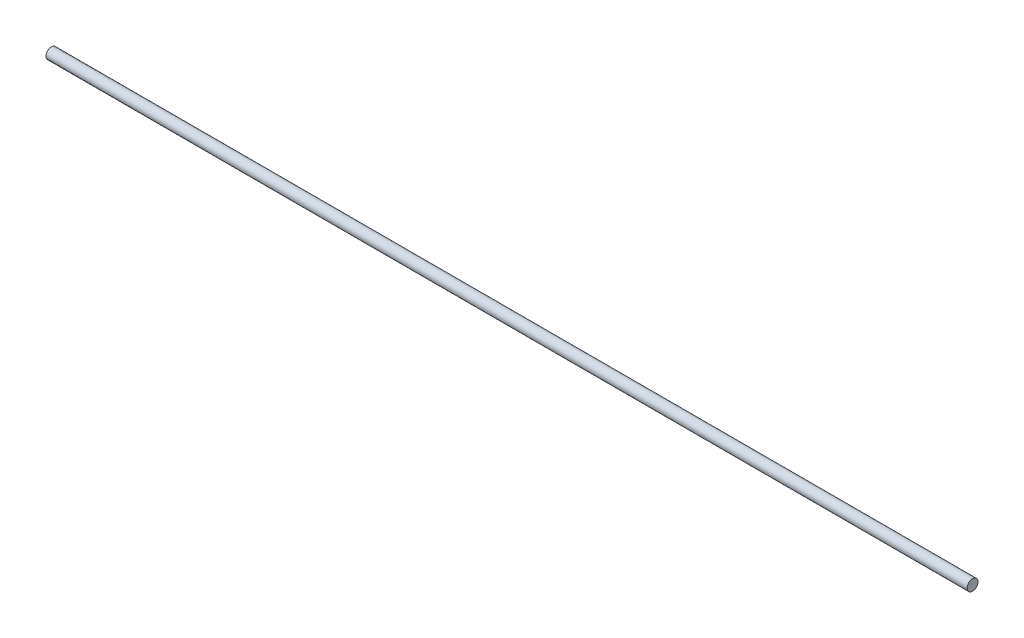
ISO-10303-21;
HEADER;
FILE_DESCRIPTION(('STEP AP214'),'2;1');
FILE_NAME('part.step','',(''),(''),'','','');
FILE_SCHEMA(('AUTOMOTIVE_DESIGN { 1 0 10303 214 1 1 1 1 }'));
ENDSEC;
DATA;
#1=APPLICATION_CONTEXT('core data for automotive mechanical design processes');
#2=APPLICATION_PROTOCOL_DEFINITION('international standard','automotive_design',2000,#1);
#3=PRODUCT_CONTEXT('',#1,'mechanical');
#4=PRODUCT('Part','Part','',(#3));
#5=PRODUCT_RELATED_PRODUCT_CATEGORY('part','',(#4));
#6=PRODUCT_DEFINITION_FORMATION('','',#4);
#7=PRODUCT_DEFINITION_CONTEXT('part definition',#1,'design');
#8=PRODUCT_DEFINITION('design','',#6,#7);
#9=PRODUCT_DEFINITION_SHAPE('','',#8);
#10=(LENGTH_UNIT() NAMED_UNIT(*) SI_UNIT(.MILLI.,.METRE.));
#11=(NAMED_UNIT(*) PLANE_ANGLE_UNIT() SI_UNIT($,.RADIAN.));
#12=(NAMED_UNIT(*) SI_UNIT($,.STERADIAN.) SOLID_ANGLE_UNIT());
#13=UNCERTAINTY_MEASURE_WITH_UNIT(LENGTH_MEASURE(1.E-05),#10,'distance_accuracy_value','');
#14=(GEOMETRIC_REPRESENTATION_CONTEXT(3) GLOBAL_UNCERTAINTY_ASSIGNED_CONTEXT((#13)) GLOBAL_UNIT_ASSIGNED_CONTEXT((#10,
#11,#12)) REPRESENTATION_CONTEXT('',''));
#15=CARTESIAN_POINT('',(0.,0.,0.));
#16=DIRECTION('',(0.,0.,1.));
#17=DIRECTION('',(1.,0.,0.));
#18=AXIS2_PLACEMENT_3D('',#15,#16,#17);
#19=CARTESIAN_POINT('',(340.,0.,0.));
#20=DIRECTION('',(-1.,0.,0.));
#21=DIRECTION('',(0.,0.,1.));
#22=AXIS2_PLACEMENT_3D('',#19,#20,#21);
#23=CYLINDRICAL_SURFACE('',#22,2.);
#24=CARTESIAN_POINT('',(340.,0.,0.));
#25=DIRECTION('',(1.,0.,0.));
#26=DIRECTION('',(0.,0.,-1.));
#27=AXIS2_PLACEMENT_3D('',#24,#25,#26);
#28=CIRCLE('',#27,2.);
#29=CARTESIAN_POINT('',(340.,0.,-2.));
#30=VERTEX_POINT('',#29);
#31=EDGE_CURVE('E10',#30,#30,#28,.T.);
#32=ORIENTED_EDGE('',*,*,#31,.F.);
#33=EDGE_LOOP('',(#32));
#34=FACE_BOUND('',#33,.T.);
#35=CARTESIAN_POINT('',(0.,0.,0.));
#36=DIRECTION('',(1.,0.,0.));
#37=DIRECTION('',(0.,0.,-1.));
#38=AXIS2_PLACEMENT_3D('',#35,#36,#37);
#39=CIRCLE('',#38,2.);
#40=CARTESIAN_POINT('',(0.,0.,-2.));
#41=VERTEX_POINT('',#40);
#42=EDGE_CURVE('E34',#41,#41,#39,.T.);
#43=ORIENTED_EDGE('',*,*,#42,.T.);
#44=EDGE_LOOP('',(#43));
#45=FACE_BOUND('',#44,.T.);
#46=ADVANCED_FACE('F31',(#34,#45),#23,.T.);
#47=CARTESIAN_POINT('',(340.,0.,0.));
#48=DIRECTION('',(1.,0.,0.));
#49=DIRECTION('',(0.,0.,-1.));
#50=AXIS2_PLACEMENT_3D('',#47,#48,#49);
#51=PLANE('',#50);
#52=ORIENTED_EDGE('',*,*,#31,.T.);
#53=EDGE_LOOP('',(#52));
#54=FACE_BOUND('',#53,.T.);
#55=ADVANCED_FACE('F46',(#54),#51,.T.);
#56=CARTESIAN_POINT('',(0.,0.,0.));
#57=DIRECTION('',(1.,0.,0.));
#58=DIRECTION('',(0.,0.,-1.));
#59=AXIS2_PLACEMENT_3D('',#56,#57,#58);
#60=PLANE('',#59);
#61=ORIENTED_EDGE('',*,*,#42,.F.);
#62=EDGE_LOOP('',(#61));
#63=FACE_BOUND('',#62,.T.);
#64=ADVANCED_FACE('F44',(#63),#60,.F.);
#65=CLOSED_SHELL('',(#46,#55,#64));
#66=MANIFOLD_SOLID_BREP('B2',#65);
#67=ADVANCED_BREP_SHAPE_REPRESENTATION('',(#18,#66),#14);
#68=SHAPE_DEFINITION_REPRESENTATION(#9,#67);
ENDSEC;
END-ISO-10303-21;
